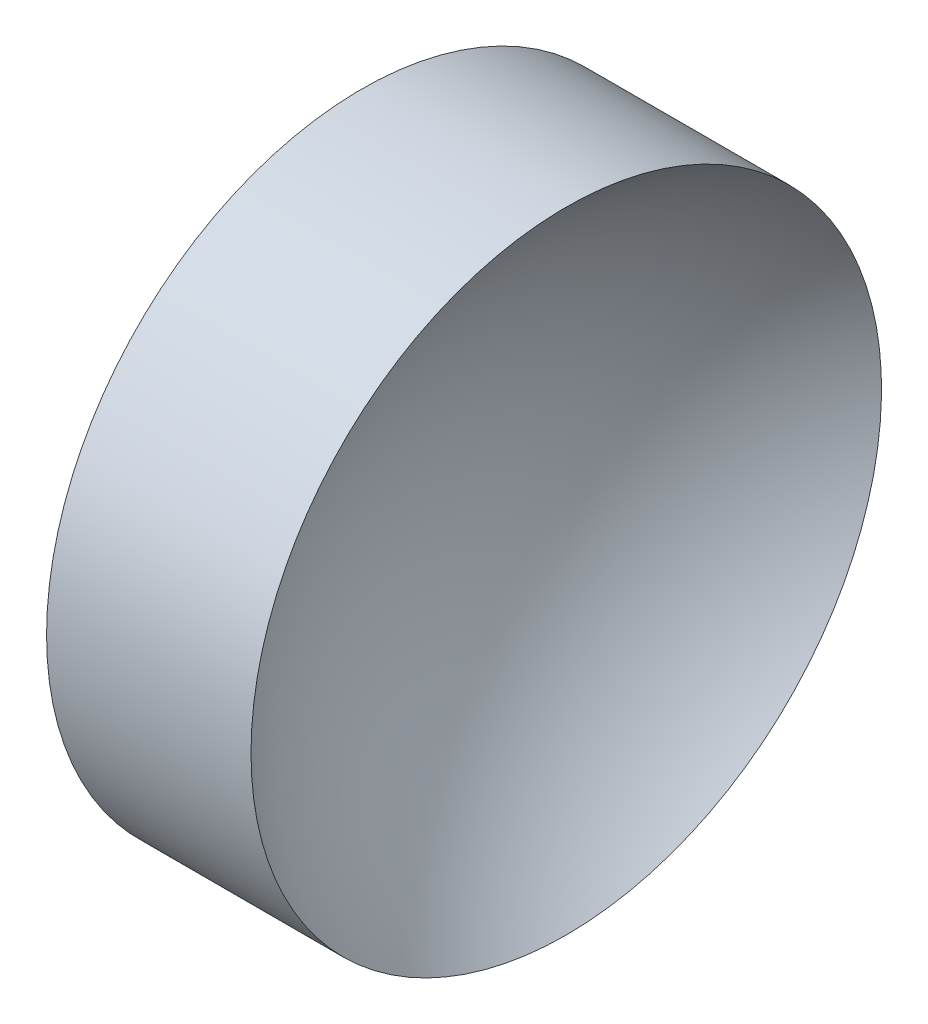
ISO-10303-21;
HEADER;
FILE_DESCRIPTION(('STEP AP214'),'2;1');
FILE_NAME('part.step','',(''),(''),'','','');
FILE_SCHEMA(('AUTOMOTIVE_DESIGN { 1 0 10303 214 1 1 1 1 }'));
ENDSEC;
DATA;
#1=APPLICATION_CONTEXT('core data for automotive mechanical design processes');
#2=APPLICATION_PROTOCOL_DEFINITION('international standard','automotive_design',2000,#1);
#3=PRODUCT_CONTEXT('',#1,'mechanical');
#4=PRODUCT('Part','Part','',(#3));
#5=PRODUCT_RELATED_PRODUCT_CATEGORY('part','',(#4));
#6=PRODUCT_DEFINITION_FORMATION('','',#4);
#7=PRODUCT_DEFINITION_CONTEXT('part definition',#1,'design');
#8=PRODUCT_DEFINITION('design','',#6,#7);
#9=PRODUCT_DEFINITION_SHAPE('','',#8);
#10=(LENGTH_UNIT() NAMED_UNIT(*) SI_UNIT(.MILLI.,.METRE.));
#11=(NAMED_UNIT(*) PLANE_ANGLE_UNIT() SI_UNIT($,.RADIAN.));
#12=(NAMED_UNIT(*) SI_UNIT($,.STERADIAN.) SOLID_ANGLE_UNIT());
#13=UNCERTAINTY_MEASURE_WITH_UNIT(LENGTH_MEASURE(1.E-05),#10,'distance_accuracy_value','');
#14=(GEOMETRIC_REPRESENTATION_CONTEXT(3) GLOBAL_UNCERTAINTY_ASSIGNED_CONTEXT((#13)) GLOBAL_UNIT_ASSIGNED_CONTEXT((#10,
#11,#12)) REPRESENTATION_CONTEXT('',''));
#15=CARTESIAN_POINT('',(0.,0.,0.));
#16=DIRECTION('',(0.,0.,1.));
#17=DIRECTION('',(1.,0.,0.));
#18=AXIS2_PLACEMENT_3D('',#15,#16,#17);
#19=CARTESIAN_POINT('',(137.412930792035,71.1939890865937,0.));
#20=DIRECTION('',(-1.,0.,0.));
#21=DIRECTION('',(0.,-1.,0.));
#22=AXIS2_PLACEMENT_3D('',#19,#20,#21);
#23=SPHERICAL_SURFACE('',#22,16.05);
#24=CARTESIAN_POINT('',(127.599037578839,71.1939890865937,0.));
#25=DIRECTION('',(-1.,0.,0.));
#26=DIRECTION('',(0.,0.,1.));
#27=AXIS2_PLACEMENT_3D('',#24,#25,#26);
#28=CIRCLE('',#27,12.7);
#29=CARTESIAN_POINT('',(127.599037578839,71.1939890865937,12.7));
#30=VERTEX_POINT('',#29);
#31=EDGE_CURVE('E10',#30,#30,#28,.T.);
#32=ORIENTED_EDGE('',*,*,#31,.F.);
#33=EDGE_LOOP('',(#32));
#34=FACE_BOUND('',#33,.T.);
#35=ADVANCED_FACE('F35',(#34),#23,.F.);
#36=CARTESIAN_POINT('',(111.955229757561,71.1939890865937,0.));
#37=DIRECTION('',(-1.,0.,0.));
#38=DIRECTION('',(0.,0.,1.));
#39=AXIS2_PLACEMENT_3D('',#36,#37,#38);
#40=CYLINDRICAL_SURFACE('',#39,12.7);
#41=CARTESIAN_POINT('',(119.362930792035,71.1939890865937,0.));
#42=DIRECTION('',(-1.,0.,0.));
#43=DIRECTION('',(0.,0.,1.));
#44=AXIS2_PLACEMENT_3D('',#41,#42,#43);
#45=CIRCLE('',#44,12.7);
#46=CARTESIAN_POINT('',(119.362930792035,71.1939890865937,12.7));
#47=VERTEX_POINT('',#46);
#48=EDGE_CURVE('E41',#47,#47,#45,.T.);
#49=ORIENTED_EDGE('',*,*,#48,.F.);
#50=EDGE_LOOP('',(#49));
#51=FACE_BOUND('',#50,.T.);
#52=ORIENTED_EDGE('',*,*,#31,.T.);
#53=EDGE_LOOP('',(#52));
#54=FACE_BOUND('',#53,.T.);
#55=ADVANCED_FACE('F49',(#51,#54),#40,.T.);
#56=CARTESIAN_POINT('',(119.362930792035,71.1939890865937,0.));
#57=DIRECTION('',(1.,0.,0.));
#58=DIRECTION('',(0.,0.,-1.));
#59=AXIS2_PLACEMENT_3D('',#56,#57,#58);
#60=PLANE('',#59);
#61=ORIENTED_EDGE('',*,*,#48,.T.);
#62=EDGE_LOOP('',(#61));
#63=FACE_BOUND('',#62,.T.);
#64=ADVANCED_FACE('F47',(#63),#60,.F.);
#65=CLOSED_SHELL('',(#35,#55,#64));
#66=MANIFOLD_SOLID_BREP('B2',#65);
#67=ADVANCED_BREP_SHAPE_REPRESENTATION('',(#18,#66),#14);
#68=SHAPE_DEFINITION_REPRESENTATION(#9,#67);
ENDSEC;
END-ISO-10303-21;
